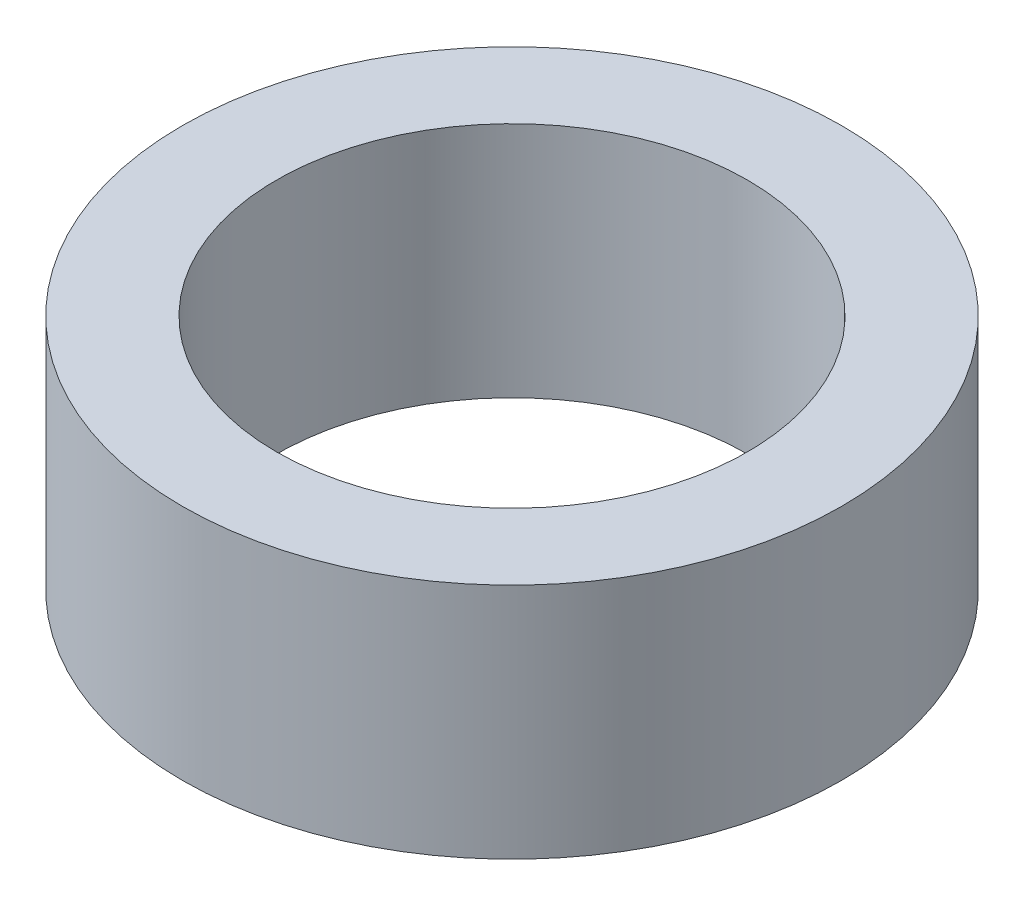
ISO-10303-21;
HEADER;
FILE_DESCRIPTION(('STEP AP214'),'2;1');
FILE_NAME('part.step','',(''),(''),'','','');
FILE_SCHEMA(('AUTOMOTIVE_DESIGN { 1 0 10303 214 1 1 1 1 }'));
ENDSEC;
DATA;
#1=APPLICATION_CONTEXT('core data for automotive mechanical design processes');
#2=APPLICATION_PROTOCOL_DEFINITION('international standard','automotive_design',2000,#1);
#3=PRODUCT_CONTEXT('',#1,'mechanical');
#4=PRODUCT('Part','Part','',(#3));
#5=PRODUCT_RELATED_PRODUCT_CATEGORY('part','',(#4));
#6=PRODUCT_DEFINITION_FORMATION('','',#4);
#7=PRODUCT_DEFINITION_CONTEXT('part definition',#1,'design');
#8=PRODUCT_DEFINITION('design','',#6,#7);
#9=PRODUCT_DEFINITION_SHAPE('','',#8);
#10=(LENGTH_UNIT() NAMED_UNIT(*) SI_UNIT(.MILLI.,.METRE.));
#11=(NAMED_UNIT(*) PLANE_ANGLE_UNIT() SI_UNIT($,.RADIAN.));
#12=(NAMED_UNIT(*) SI_UNIT($,.STERADIAN.) SOLID_ANGLE_UNIT());
#13=UNCERTAINTY_MEASURE_WITH_UNIT(LENGTH_MEASURE(1.E-05),#10,'distance_accuracy_value','');
#14=(GEOMETRIC_REPRESENTATION_CONTEXT(3) GLOBAL_UNCERTAINTY_ASSIGNED_CONTEXT((#13)) GLOBAL_UNIT_ASSIGNED_CONTEXT((#10,
#11,#12)) REPRESENTATION_CONTEXT('',''));
#15=CARTESIAN_POINT('',(0.,0.,0.));
#16=DIRECTION('',(0.,0.,1.));
#17=DIRECTION('',(1.,0.,0.));
#18=AXIS2_PLACEMENT_3D('',#15,#16,#17);
#19=CARTESIAN_POINT('',(0.,1.6,0.));
#20=DIRECTION('',(0.,1.,0.));
#21=DIRECTION('',(0.,0.,1.));
#22=AXIS2_PLACEMENT_3D('',#19,#20,#21);
#23=PLANE('',#22);
#24=CARTESIAN_POINT('',(0.,1.6,0.));
#25=DIRECTION('',(0.,1.,0.));
#26=DIRECTION('',(0.,0.,1.));
#27=AXIS2_PLACEMENT_3D('',#24,#25,#26);
#28=CIRCLE('',#27,2.2225);
#29=CARTESIAN_POINT('',(0.,1.6,2.2225));
#30=VERTEX_POINT('',#29);
#31=EDGE_CURVE('E10',#30,#30,#28,.T.);
#32=ORIENTED_EDGE('',*,*,#31,.T.);
#33=EDGE_LOOP('',(#32));
#34=FACE_BOUND('',#33,.T.);
#35=CARTESIAN_POINT('',(0.,1.6,0.));
#36=DIRECTION('',(0.,1.,0.));
#37=DIRECTION('',(0.,0.,1.));
#38=AXIS2_PLACEMENT_3D('',#35,#36,#37);
#39=CIRCLE('',#38,1.5875);
#40=CARTESIAN_POINT('',(0.,1.6,1.5875));
#41=VERTEX_POINT('',#40);
#42=EDGE_CURVE('E54',#41,#41,#39,.T.);
#43=ORIENTED_EDGE('',*,*,#42,.F.);
#44=EDGE_LOOP('',(#43));
#45=FACE_BOUND('',#44,.T.);
#46=ADVANCED_FACE('F39',(#34,#45),#23,.T.);
#47=CARTESIAN_POINT('',(0.,0.,0.));
#48=DIRECTION('',(0.,1.,0.));
#49=DIRECTION('',(0.,0.,1.));
#50=AXIS2_PLACEMENT_3D('',#47,#48,#49);
#51=PLANE('',#50);
#52=CARTESIAN_POINT('',(0.,0.,0.));
#53=DIRECTION('',(0.,1.,0.));
#54=DIRECTION('',(0.,0.,1.));
#55=AXIS2_PLACEMENT_3D('',#52,#53,#54);
#56=CIRCLE('',#55,2.2225);
#57=CARTESIAN_POINT('',(0.,0.,2.2225));
#58=VERTEX_POINT('',#57);
#59=EDGE_CURVE('E43',#58,#58,#56,.T.);
#60=ORIENTED_EDGE('',*,*,#59,.F.);
#61=EDGE_LOOP('',(#60));
#62=FACE_BOUND('',#61,.T.);
#63=CARTESIAN_POINT('',(0.,0.,0.));
#64=DIRECTION('',(0.,1.,0.));
#65=DIRECTION('',(0.,0.,1.));
#66=AXIS2_PLACEMENT_3D('',#63,#64,#65);
#67=CIRCLE('',#66,1.5875);
#68=CARTESIAN_POINT('',(0.,0.,1.5875));
#69=VERTEX_POINT('',#68);
#70=EDGE_CURVE('E56',#69,#69,#67,.T.);
#71=ORIENTED_EDGE('',*,*,#70,.T.);
#72=EDGE_LOOP('',(#71));
#73=FACE_BOUND('',#72,.T.);
#74=ADVANCED_FACE('F66',(#62,#73),#51,.F.);
#75=CARTESIAN_POINT('',(0.,1.6,0.));
#76=DIRECTION('',(0.,-1.,0.));
#77=DIRECTION('',(0.,0.,-1.));
#78=AXIS2_PLACEMENT_3D('',#75,#76,#77);
#79=CYLINDRICAL_SURFACE('',#78,2.2225);
#80=ORIENTED_EDGE('',*,*,#31,.F.);
#81=EDGE_LOOP('',(#80));
#82=FACE_BOUND('',#81,.T.);
#83=ORIENTED_EDGE('',*,*,#59,.T.);
#84=EDGE_LOOP('',(#83));
#85=FACE_BOUND('',#84,.T.);
#86=ADVANCED_FACE('F41',(#82,#85),#79,.T.);
#87=CARTESIAN_POINT('',(0.,1.6,0.));
#88=DIRECTION('',(0.,-1.,0.));
#89=DIRECTION('',(0.,0.,-1.));
#90=AXIS2_PLACEMENT_3D('',#87,#88,#89);
#91=CYLINDRICAL_SURFACE('',#90,1.5875);
#92=ORIENTED_EDGE('',*,*,#42,.T.);
#93=EDGE_LOOP('',(#92));
#94=FACE_BOUND('',#93,.T.);
#95=ORIENTED_EDGE('',*,*,#70,.F.);
#96=EDGE_LOOP('',(#95));
#97=FACE_BOUND('',#96,.T.);
#98=ADVANCED_FACE('F62',(#94,#97),#91,.F.);
#99=CLOSED_SHELL('',(#46,#74,#86,#98));
#100=MANIFOLD_SOLID_BREP('B2',#99);
#101=ADVANCED_BREP_SHAPE_REPRESENTATION('',(#18,#100),#14);
#102=SHAPE_DEFINITION_REPRESENTATION(#9,#101);
ENDSEC;
END-ISO-10303-21;
